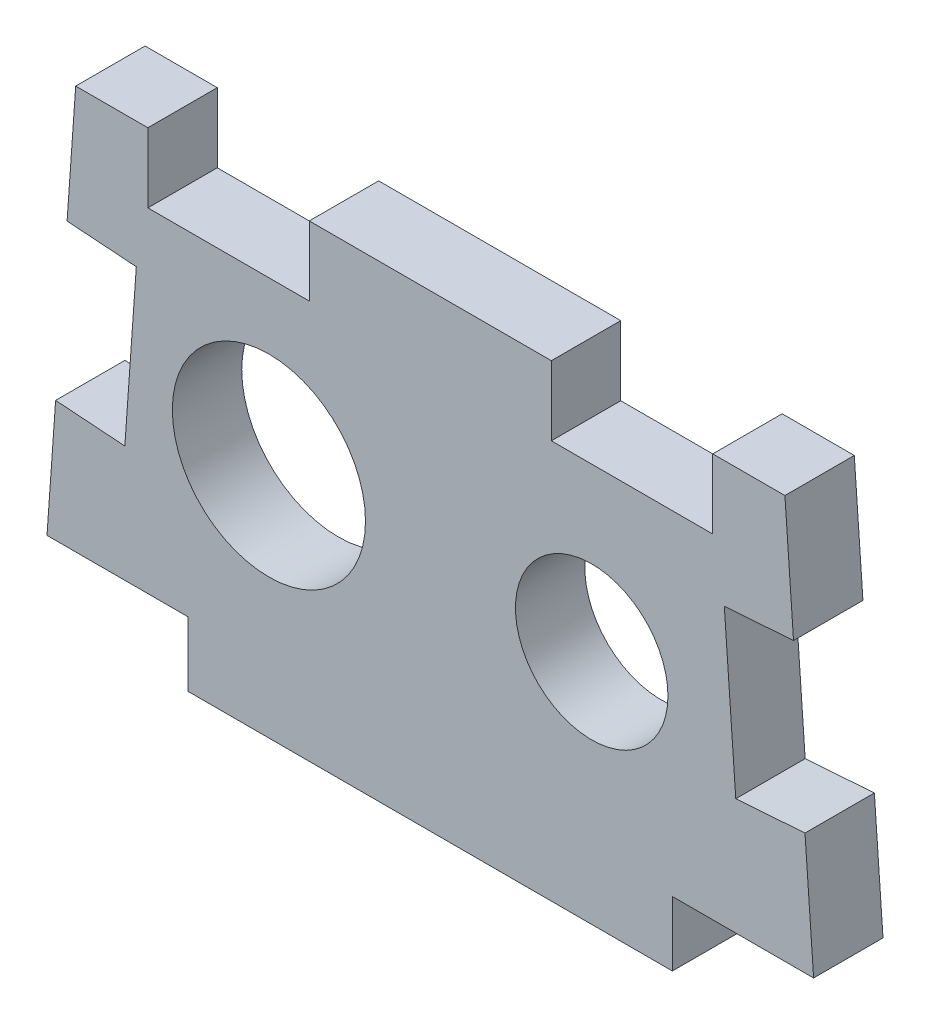
ISO-10303-21;
HEADER;
FILE_DESCRIPTION(('STEP AP214'),'2;1');
FILE_NAME('part.step','',(''),(''),'','','');
FILE_SCHEMA(('AUTOMOTIVE_DESIGN { 1 0 10303 214 1 1 1 1 }'));
ENDSEC;
DATA;
#1=APPLICATION_CONTEXT('core data for automotive mechanical design processes');
#2=APPLICATION_PROTOCOL_DEFINITION('international standard','automotive_design',2000,#1);
#3=PRODUCT_CONTEXT('',#1,'mechanical');
#4=PRODUCT('Part','Part','',(#3));
#5=PRODUCT_RELATED_PRODUCT_CATEGORY('part','',(#4));
#6=PRODUCT_DEFINITION_FORMATION('','',#4);
#7=PRODUCT_DEFINITION_CONTEXT('part definition',#1,'design');
#8=PRODUCT_DEFINITION('design','',#6,#7);
#9=PRODUCT_DEFINITION_SHAPE('','',#8);
#10=(LENGTH_UNIT() NAMED_UNIT(*) SI_UNIT(.MILLI.,.METRE.));
#11=(NAMED_UNIT(*) PLANE_ANGLE_UNIT() SI_UNIT($,.RADIAN.));
#12=(NAMED_UNIT(*) SI_UNIT($,.STERADIAN.) SOLID_ANGLE_UNIT());
#13=UNCERTAINTY_MEASURE_WITH_UNIT(LENGTH_MEASURE(1.E-05),#10,'distance_accuracy_value','');
#14=(GEOMETRIC_REPRESENTATION_CONTEXT(3) GLOBAL_UNCERTAINTY_ASSIGNED_CONTEXT((#13)) GLOBAL_UNIT_ASSIGNED_CONTEXT((#10,
#11,#12)) REPRESENTATION_CONTEXT('',''));
#15=CARTESIAN_POINT('',(0.,0.,0.));
#16=DIRECTION('',(0.,0.,1.));
#17=DIRECTION('',(1.,0.,0.));
#18=AXIS2_PLACEMENT_3D('',#15,#16,#17);
#19=CARTESIAN_POINT('',(-30.1625,-16.4925485415277,5.461));
#20=DIRECTION('',(0.,1.,0.));
#21=DIRECTION('',(0.,0.,1.));
#22=AXIS2_PLACEMENT_3D('',#19,#20,#21);
#23=PLANE('',#22);
#24=DIRECTION('',(0.,0.,1.));
#25=VECTOR('',#24,1.);
#26=CARTESIAN_POINT('',(19.05,-16.4925485415277,-38.4371747140707));
#27=LINE('',#26,#25);
#28=CARTESIAN_POINT('',(19.05,-16.4925485415277,0.));
#29=VERTEX_POINT('',#28);
#30=CARTESIAN_POINT('',(19.05,-16.4925485415277,5.461));
#31=VERTEX_POINT('',#30);
#32=EDGE_CURVE('E56',#29,#31,#27,.T.);
#33=ORIENTED_EDGE('',*,*,#32,.F.);
#34=DIRECTION('',(1.,0.,0.));
#35=VECTOR('',#34,1.);
#36=CARTESIAN_POINT('',(-30.1625,-16.4925485415277,0.));
#37=LINE('',#36,#35);
#38=CARTESIAN_POINT('',(30.1625,-16.4925485415277,0.));
#39=VERTEX_POINT('',#38);
#40=EDGE_CURVE('E376',#29,#39,#37,.T.);
#41=ORIENTED_EDGE('',*,*,#40,.T.);
#42=DIRECTION('',(0.,0.,-1.));
#43=VECTOR('',#42,1.);
#44=CARTESIAN_POINT('',(30.1625,-16.4925485415277,5.461));
#45=LINE('',#44,#43);
#46=CARTESIAN_POINT('',(30.1625,-16.4925485415277,5.461));
#47=VERTEX_POINT('',#46);
#48=EDGE_CURVE('E363',#47,#39,#45,.T.);
#49=ORIENTED_EDGE('',*,*,#48,.F.);
#50=DIRECTION('',(1.,0.,0.));
#51=VECTOR('',#50,1.);
#52=CARTESIAN_POINT('',(-30.1625,-16.4925485415277,5.461));
#53=LINE('',#52,#51);
#54=EDGE_CURVE('E361',#31,#47,#53,.T.);
#55=ORIENTED_EDGE('',*,*,#54,.F.);
#56=EDGE_LOOP('',(#33,#41,#49,#55));
#57=FACE_BOUND('',#56,.T.);
#58=ADVANCED_FACE('F33',(#57),#23,.F.);
#59=CARTESIAN_POINT('',(27.9036850161391,15.2574514584723,5.461));
#60=DIRECTION('',(-0.997478847817171,-0.0709644147254725,0.));
#61=DIRECTION('',(0.0709644147254726,-0.997478847817171,0.));
#62=AXIS2_PLACEMENT_3D('',#59,#60,#61);
#63=PLANE('',#62);
#64=DIRECTION('',(-0.0709644147254725,0.997478847817171,0.));
#65=VECTOR('',#64,1.);
#66=CARTESIAN_POINT('',(27.9036850161391,15.2574514584723,5.461));
#67=LINE('',#66,#65);
#68=CARTESIAN_POINT('',(28.5824684745628,5.71644214211136,5.461));
#69=VERTEX_POINT('',#68);
#70=CARTESIAN_POINT('',(27.9036850161391,15.2574514584723,5.461));
#71=VERTEX_POINT('',#70);
#72=EDGE_CURVE('E352',#69,#71,#67,.T.);
#73=ORIENTED_EDGE('',*,*,#72,.F.);
#74=DIRECTION('',(0.,0.,1.));
#75=VECTOR('',#74,1.);
#76=CARTESIAN_POINT('',(28.5824684745628,5.71644214211136,0.));
#77=LINE('',#76,#75);
#78=CARTESIAN_POINT('',(28.5824684745628,5.71644214211136,0.));
#79=VERTEX_POINT('',#78);
#80=EDGE_CURVE('E275',#79,#69,#77,.T.);
#81=ORIENTED_EDGE('',*,*,#80,.F.);
#82=DIRECTION('',(-0.0709644147254725,0.997478847817171,0.));
#83=VECTOR('',#82,1.);
#84=CARTESIAN_POINT('',(27.9036850161391,15.2574514584723,0.));
#85=LINE('',#84,#83);
#86=CARTESIAN_POINT('',(27.9036850161391,15.2574514584723,0.));
#87=VERTEX_POINT('',#86);
#88=EDGE_CURVE('E345',#79,#87,#85,.T.);
#89=ORIENTED_EDGE('',*,*,#88,.T.);
#90=DIRECTION('',(0.,0.,-1.));
#91=VECTOR('',#90,1.);
#92=CARTESIAN_POINT('',(27.9036850161391,15.2574514584723,5.461));
#93=LINE('',#92,#91);
#94=EDGE_CURVE('E11',#71,#87,#93,.T.);
#95=ORIENTED_EDGE('',*,*,#94,.F.);
#96=EDGE_LOOP('',(#73,#81,#89,#95));
#97=FACE_BOUND('',#96,.T.);
#98=ADVANCED_FACE('F433',(#97),#63,.F.);
#99=CARTESIAN_POINT('',(-27.903685016139,15.2574514584723,5.461));
#100=DIRECTION('',(0.,-1.,0.));
#101=DIRECTION('',(0.,0.,-1.));
#102=AXIS2_PLACEMENT_3D('',#99,#100,#101);
#103=PLANE('',#102);
#104=DIRECTION('',(-1.,0.,0.));
#105=VECTOR('',#104,1.);
#106=CARTESIAN_POINT('',(-27.903685016139,15.2574514584723,0.));
#107=LINE('',#106,#105);
#108=CARTESIAN_POINT('',(22.225,15.2574514584723,0.));
#109=VERTEX_POINT('',#108);
#110=EDGE_CURVE('E368',#87,#109,#107,.T.);
#111=ORIENTED_EDGE('',*,*,#110,.T.);
#112=DIRECTION('',(0.,0.,1.));
#113=VECTOR('',#112,1.);
#114=CARTESIAN_POINT('',(22.225,15.2574514584723,0.));
#115=LINE('',#114,#113);
#116=CARTESIAN_POINT('',(22.225,15.2574514584723,5.461));
#117=VERTEX_POINT('',#116);
#118=EDGE_CURVE('E242',#109,#117,#115,.T.);
#119=ORIENTED_EDGE('',*,*,#118,.T.);
#120=DIRECTION('',(-1.,0.,0.));
#121=VECTOR('',#120,1.);
#122=CARTESIAN_POINT('',(-27.903685016139,15.2574514584723,5.461));
#123=LINE('',#122,#121);
#124=EDGE_CURVE('E353',#71,#117,#123,.T.);
#125=ORIENTED_EDGE('',*,*,#124,.F.);
#126=ORIENTED_EDGE('',*,*,#94,.T.);
#127=EDGE_LOOP('',(#111,#119,#125,#126));
#128=FACE_BOUND('',#127,.T.);
#129=ADVANCED_FACE('F426',(#128),#103,.F.);
#130=CARTESIAN_POINT('',(-22.225,15.2574514584723,5.461));
#131=VERTEX_POINT('',#130);
#132=CARTESIAN_POINT('',(-27.903685016139,15.2574514584723,5.461));
#133=VERTEX_POINT('',#132);
#134=EDGE_CURVE('E351',#131,#133,#123,.T.);
#135=ORIENTED_EDGE('',*,*,#134,.F.);
#136=DIRECTION('',(0.,0.,1.));
#137=VECTOR('',#136,1.);
#138=CARTESIAN_POINT('',(-22.225,15.2574514584723,0.));
#139=LINE('',#138,#137);
#140=CARTESIAN_POINT('',(-22.225,15.2574514584723,0.));
#141=VERTEX_POINT('',#140);
#142=EDGE_CURVE('E327',#141,#131,#139,.T.);
#143=ORIENTED_EDGE('',*,*,#142,.F.);
#144=CARTESIAN_POINT('',(-27.903685016139,15.2574514584723,0.));
#145=VERTEX_POINT('',#144);
#146=EDGE_CURVE('E367',#141,#145,#107,.T.);
#147=ORIENTED_EDGE('',*,*,#146,.T.);
#148=DIRECTION('',(0.,0.,-1.));
#149=VECTOR('',#148,1.);
#150=CARTESIAN_POINT('',(-27.903685016139,15.2574514584723,5.461));
#151=LINE('',#150,#149);
#152=EDGE_CURVE('E41',#133,#145,#151,.T.);
#153=ORIENTED_EDGE('',*,*,#152,.F.);
#154=EDGE_LOOP('',(#135,#143,#147,#153));
#155=FACE_BOUND('',#154,.T.);
#156=ADVANCED_FACE('F423',(#155),#103,.F.);
#157=CARTESIAN_POINT('',(-27.903685016139,15.2574514584723,5.461));
#158=DIRECTION('',(0.997478847817171,-0.0709644147254746,0.));
#159=DIRECTION('',(0.0709644147254746,0.997478847817171,0.));
#160=AXIS2_PLACEMENT_3D('',#157,#158,#159);
#161=PLANE('',#160);
#162=DIRECTION('',(-0.0709644147254746,-0.997478847817171,0.));
#163=VECTOR('',#162,1.);
#164=CARTESIAN_POINT('',(-27.903685016139,15.2574514584723,5.461));
#165=LINE('',#164,#163);
#166=CARTESIAN_POINT('',(-29.4837165415763,-6.95153922516671,5.461));
#167=VERTEX_POINT('',#166);
#168=CARTESIAN_POINT('',(-30.1625,-16.4925485415277,5.461));
#169=VERTEX_POINT('',#168);
#170=EDGE_CURVE('E356',#167,#169,#165,.T.);
#171=ORIENTED_EDGE('',*,*,#170,.F.);
#172=DIRECTION('',(0.,0.,1.));
#173=VECTOR('',#172,1.);
#174=CARTESIAN_POINT('',(-29.4837165415763,-6.95153922516671,0.));
#175=LINE('',#174,#173);
#176=CARTESIAN_POINT('',(-29.4837165415763,-6.95153922516671,0.));
#177=VERTEX_POINT('',#176);
#178=EDGE_CURVE('E246',#177,#167,#175,.T.);
#179=ORIENTED_EDGE('',*,*,#178,.F.);
#180=DIRECTION('',(-0.0709644147254746,-0.997478847817171,0.));
#181=VECTOR('',#180,1.);
#182=CARTESIAN_POINT('',(-27.903685016139,15.2574514584723,0.));
#183=LINE('',#182,#181);
#184=CARTESIAN_POINT('',(-30.1625,-16.4925485415277,0.));
#185=VERTEX_POINT('',#184);
#186=EDGE_CURVE('E371',#177,#185,#183,.T.);
#187=ORIENTED_EDGE('',*,*,#186,.T.);
#188=DIRECTION('',(0.,0.,-1.));
#189=VECTOR('',#188,1.);
#190=CARTESIAN_POINT('',(-30.1625,-16.4925485415277,5.461));
#191=LINE('',#190,#189);
#192=EDGE_CURVE('E381',#169,#185,#191,.T.);
#193=ORIENTED_EDGE('',*,*,#192,.F.);
#194=EDGE_LOOP('',(#171,#179,#187,#193));
#195=FACE_BOUND('',#194,.T.);
#196=ADVANCED_FACE('F425',(#195),#161,.F.);
#197=CARTESIAN_POINT('',(0.,0.,5.461));
#198=DIRECTION('',(0.,0.,1.));
#199=DIRECTION('',(1.,0.,0.));
#200=AXIS2_PLACEMENT_3D('',#197,#198,#199);
#201=PLANE('',#200);
#202=DIRECTION('',(-0.997478847817171,-0.0709644147254728,0.));
#203=VECTOR('',#202,1.);
#204=CARTESIAN_POINT('',(28.5824684745628,5.71644214211136,5.461));
#205=LINE('',#204,#203);
#206=CARTESIAN_POINT('',(23.1352364866332,5.32890547329556,5.461));
#207=VERTEX_POINT('',#206);
#208=EDGE_CURVE('E231',#69,#207,#205,.T.);
#209=ORIENTED_EDGE('',*,*,#208,.F.);
#210=ORIENTED_EDGE('',*,*,#72,.T.);
#211=ORIENTED_EDGE('',*,*,#124,.T.);
#212=DIRECTION('',(0.,1.,0.));
#213=VECTOR('',#212,1.);
#214=CARTESIAN_POINT('',(22.225,15.2574514584723,5.461));
#215=LINE('',#214,#213);
#216=CARTESIAN_POINT('',(22.225,9.79645145847233,5.461));
#217=VERTEX_POINT('',#216);
#218=EDGE_CURVE('E243',#217,#117,#215,.T.);
#219=ORIENTED_EDGE('',*,*,#218,.F.);
#220=DIRECTION('',(1.,0.,0.));
#221=VECTOR('',#220,1.);
#222=CARTESIAN_POINT('',(22.225,9.79645145847233,5.461));
#223=LINE('',#222,#221);
#224=CARTESIAN_POINT('',(9.525,9.79645145847233,5.461));
#225=VERTEX_POINT('',#224);
#226=EDGE_CURVE('E236',#225,#217,#223,.T.);
#227=ORIENTED_EDGE('',*,*,#226,.F.);
#228=DIRECTION('',(0.,-1.,0.));
#229=VECTOR('',#228,1.);
#230=CARTESIAN_POINT('',(9.525,15.2574514584723,5.461));
#231=LINE('',#230,#229);
#232=CARTESIAN_POINT('',(9.525,15.2574514584723,5.461));
#233=VERTEX_POINT('',#232);
#234=EDGE_CURVE('E245',#233,#225,#231,.T.);
#235=ORIENTED_EDGE('',*,*,#234,.F.);
#236=CARTESIAN_POINT('',(-9.52500000000001,15.2574514584723,5.461));
#237=VERTEX_POINT('',#236);
#238=EDGE_CURVE('E357',#233,#237,#123,.T.);
#239=ORIENTED_EDGE('',*,*,#238,.T.);
#240=DIRECTION('',(0.,1.,0.));
#241=VECTOR('',#240,1.);
#242=CARTESIAN_POINT('',(-9.525,15.2574514584723,5.461));
#243=LINE('',#242,#241);
#244=CARTESIAN_POINT('',(-9.525,9.79645145847233,5.461));
#245=VERTEX_POINT('',#244);
#246=EDGE_CURVE('E314',#245,#237,#243,.T.);
#247=ORIENTED_EDGE('',*,*,#246,.F.);
#248=DIRECTION('',(1.,0.,0.));
#249=VECTOR('',#248,1.);
#250=CARTESIAN_POINT('',(-22.225,9.79645145847233,5.461));
#251=LINE('',#250,#249);
#252=CARTESIAN_POINT('',(-22.225,9.79645145847233,5.461));
#253=VERTEX_POINT('',#252);
#254=EDGE_CURVE('E323',#253,#245,#251,.T.);
#255=ORIENTED_EDGE('',*,*,#254,.F.);
#256=DIRECTION('',(0.,-1.,0.));
#257=VECTOR('',#256,1.);
#258=CARTESIAN_POINT('',(-22.225,15.2574514584723,5.461));
#259=LINE('',#258,#257);
#260=EDGE_CURVE('E253',#131,#253,#259,.T.);
#261=ORIENTED_EDGE('',*,*,#260,.F.);
#262=ORIENTED_EDGE('',*,*,#134,.T.);
#263=CARTESIAN_POINT('',(-28.5824684745628,5.71644214211136,5.461));
#264=VERTEX_POINT('',#263);
#265=EDGE_CURVE('E358',#133,#264,#165,.T.);
#266=ORIENTED_EDGE('',*,*,#265,.T.);
#267=DIRECTION('',(-0.997478847817171,0.0709644147254748,0.));
#268=VECTOR('',#267,1.);
#269=CARTESIAN_POINT('',(-28.5824684745628,5.71644214211136,5.461));
#270=LINE('',#269,#268);
#271=CARTESIAN_POINT('',(-23.1352364866332,5.32890547329554,5.461));
#272=VERTEX_POINT('',#271);
#273=EDGE_CURVE('E264',#272,#264,#270,.T.);
#274=ORIENTED_EDGE('',*,*,#273,.F.);
#275=DIRECTION('',(0.0709644147254746,0.997478847817171,0.));
#276=VECTOR('',#275,1.);
#277=CARTESIAN_POINT('',(-24.0364845536467,-7.33907589398252,5.461));
#278=LINE('',#277,#276);
#279=CARTESIAN_POINT('',(-24.0364845536467,-7.33907589398252,5.461));
#280=VERTEX_POINT('',#279);
#281=EDGE_CURVE('E274',#280,#272,#278,.T.);
#282=ORIENTED_EDGE('',*,*,#281,.F.);
#283=DIRECTION('',(0.997478847817171,-0.0709644147254751,0.));
#284=VECTOR('',#283,1.);
#285=CARTESIAN_POINT('',(-29.4837165415763,-6.95153922516671,5.461));
#286=LINE('',#285,#284);
#287=EDGE_CURVE('E271',#167,#280,#286,.T.);
#288=ORIENTED_EDGE('',*,*,#287,.F.);
#289=ORIENTED_EDGE('',*,*,#170,.T.);
#290=CARTESIAN_POINT('',(-19.05,-16.4925485415277,5.461));
#291=VERTEX_POINT('',#290);
#292=EDGE_CURVE('E219',#169,#291,#53,.T.);
#293=ORIENTED_EDGE('',*,*,#292,.T.);
#294=DIRECTION('',(0.,-1.,0.));
#295=VECTOR('',#294,1.);
#296=CARTESIAN_POINT('',(-19.05,-16.4925485415277,5.461));
#297=LINE('',#296,#295);
#298=CARTESIAN_POINT('',(-19.05,-21.5725485415277,5.461));
#299=VERTEX_POINT('',#298);
#300=EDGE_CURVE('E200',#291,#299,#297,.T.);
#301=ORIENTED_EDGE('',*,*,#300,.T.);
#302=DIRECTION('',(1.,0.,0.));
#303=VECTOR('',#302,1.);
#304=CARTESIAN_POINT('',(-19.05,-21.5725485415277,5.461));
#305=LINE('',#304,#303);
#306=CARTESIAN_POINT('',(19.05,-21.5725485415277,5.461));
#307=VERTEX_POINT('',#306);
#308=EDGE_CURVE('E209',#299,#307,#305,.T.);
#309=ORIENTED_EDGE('',*,*,#308,.T.);
#310=DIRECTION('',(0.,1.,0.));
#311=VECTOR('',#310,1.);
#312=CARTESIAN_POINT('',(19.05,-16.4925485415277,5.461));
#313=LINE('',#312,#311);
#314=EDGE_CURVE('E206',#307,#31,#313,.T.);
#315=ORIENTED_EDGE('',*,*,#314,.T.);
#316=ORIENTED_EDGE('',*,*,#54,.T.);
#317=CARTESIAN_POINT('',(29.4837165415763,-6.95153922516686,5.461));
#318=VERTEX_POINT('',#317);
#319=EDGE_CURVE('E348',#47,#318,#67,.T.);
#320=ORIENTED_EDGE('',*,*,#319,.T.);
#321=DIRECTION('',(0.997478847817171,0.0709644147254721,0.));
#322=VECTOR('',#321,1.);
#323=CARTESIAN_POINT('',(29.4837165415763,-6.95153922516671,5.461));
#324=LINE('',#323,#322);
#325=CARTESIAN_POINT('',(24.0364845536467,-7.33907589398251,5.461));
#326=VERTEX_POINT('',#325);
#327=EDGE_CURVE('E290',#326,#318,#324,.T.);
#328=ORIENTED_EDGE('',*,*,#327,.F.);
#329=DIRECTION('',(0.0709644147254724,-0.997478847817171,0.));
#330=VECTOR('',#329,1.);
#331=CARTESIAN_POINT('',(23.1352364866332,5.32890547329556,5.461));
#332=LINE('',#331,#330);
#333=EDGE_CURVE('E299',#207,#326,#332,.T.);
#334=ORIENTED_EDGE('',*,*,#333,.F.);
#335=EDGE_LOOP('',(#209,#210,#211,#219,#227,#235,#239,#247,#255,#261,#262,#266,#274,#282,#288,
#289,#293,#301,#309,#315,#316,#320,#328,#334));
#336=FACE_BOUND('',#335,.T.);
#337=CARTESIAN_POINT('',(-12.7,-3.00023153008812,5.461));
#338=DIRECTION('',(0.,0.,1.));
#339=DIRECTION('',(1.,0.,0.));
#340=AXIS2_PLACEMENT_3D('',#337,#338,#339);
#341=CIRCLE('',#340,7.6);
#342=CARTESIAN_POINT('',(-5.1,-3.00023153008812,5.461));
#343=VERTEX_POINT('',#342);
#344=EDGE_CURVE('E342',#343,#343,#341,.T.);
#345=ORIENTED_EDGE('',*,*,#344,.F.);
#346=EDGE_LOOP('',(#345));
#347=FACE_BOUND('',#346,.T.);
#348=CARTESIAN_POINT('',(12.7,-3.00023153008812,5.461));
#349=DIRECTION('',(0.,0.,1.));
#350=DIRECTION('',(1.,0.,0.));
#351=AXIS2_PLACEMENT_3D('',#348,#349,#350);
#352=CIRCLE('',#351,5.99999999999999);
#353=CARTESIAN_POINT('',(18.7,-3.00023153008812,5.461));
#354=VERTEX_POINT('',#353);
#355=EDGE_CURVE('E336',#354,#354,#352,.T.);
#356=ORIENTED_EDGE('',*,*,#355,.F.);
#357=EDGE_LOOP('',(#356));
#358=FACE_BOUND('',#357,.T.);
#359=ADVANCED_FACE('F217',(#336,#347,#358),#201,.T.);
#360=CARTESIAN_POINT('',(0.,0.,0.));
#361=DIRECTION('',(0.,0.,1.));
#362=DIRECTION('',(1.,0.,0.));
#363=AXIS2_PLACEMENT_3D('',#360,#361,#362);
#364=PLANE('',#363);
#365=ORIENTED_EDGE('',*,*,#88,.F.);
#366=DIRECTION('',(-0.997478847817171,-0.0709644147254728,0.));
#367=VECTOR('',#366,1.);
#368=CARTESIAN_POINT('',(28.5824684745628,5.71644214211136,0.));
#369=LINE('',#368,#367);
#370=CARTESIAN_POINT('',(23.1352364866332,5.32890547329556,0.));
#371=VERTEX_POINT('',#370);
#372=EDGE_CURVE('E286',#79,#371,#369,.T.);
#373=ORIENTED_EDGE('',*,*,#372,.T.);
#374=DIRECTION('',(0.0709644147254724,-0.997478847817171,0.));
#375=VECTOR('',#374,1.);
#376=CARTESIAN_POINT('',(23.1352364866332,5.32890547329556,0.));
#377=LINE('',#376,#375);
#378=CARTESIAN_POINT('',(24.0364845536467,-7.33907589398251,0.));
#379=VERTEX_POINT('',#378);
#380=EDGE_CURVE('E289',#371,#379,#377,.T.);
#381=ORIENTED_EDGE('',*,*,#380,.T.);
#382=DIRECTION('',(0.997478847817171,0.0709644147254721,0.));
#383=VECTOR('',#382,1.);
#384=CARTESIAN_POINT('',(29.4837165415763,-6.95153922516671,0.));
#385=LINE('',#384,#383);
#386=CARTESIAN_POINT('',(29.4837165415763,-6.95153922516671,0.));
#387=VERTEX_POINT('',#386);
#388=EDGE_CURVE('E293',#379,#387,#385,.T.);
#389=ORIENTED_EDGE('',*,*,#388,.T.);
#390=EDGE_CURVE('E364',#39,#387,#85,.T.);
#391=ORIENTED_EDGE('',*,*,#390,.F.);
#392=ORIENTED_EDGE('',*,*,#40,.F.);
#393=DIRECTION('',(0.,-1.,0.));
#394=VECTOR('',#393,1.);
#395=CARTESIAN_POINT('',(19.05,-16.4925485415277,0.));
#396=LINE('',#395,#394);
#397=CARTESIAN_POINT('',(19.05,-21.5725485415277,0.));
#398=VERTEX_POINT('',#397);
#399=EDGE_CURVE('E226',#29,#398,#396,.T.);
#400=ORIENTED_EDGE('',*,*,#399,.T.);
#401=DIRECTION('',(-1.,0.,0.));
#402=VECTOR('',#401,1.);
#403=CARTESIAN_POINT('',(-19.05,-21.5725485415277,0.));
#404=LINE('',#403,#402);
#405=CARTESIAN_POINT('',(-19.05,-21.5725485415277,0.));
#406=VERTEX_POINT('',#405);
#407=EDGE_CURVE('E229',#398,#406,#404,.T.);
#408=ORIENTED_EDGE('',*,*,#407,.T.);
#409=DIRECTION('',(0.,1.,0.));
#410=VECTOR('',#409,1.);
#411=CARTESIAN_POINT('',(-19.05,-16.4925485415277,0.));
#412=LINE('',#411,#410);
#413=CARTESIAN_POINT('',(-19.05,-16.4925485415277,0.));
#414=VERTEX_POINT('',#413);
#415=EDGE_CURVE('E202',#406,#414,#412,.T.);
#416=ORIENTED_EDGE('',*,*,#415,.T.);
#417=EDGE_CURVE('E377',#185,#414,#37,.T.);
#418=ORIENTED_EDGE('',*,*,#417,.F.);
#419=ORIENTED_EDGE('',*,*,#186,.F.);
#420=DIRECTION('',(0.997478847817171,-0.0709644147254751,0.));
#421=VECTOR('',#420,1.);
#422=CARTESIAN_POINT('',(-29.4837165415763,-6.95153922516671,0.));
#423=LINE('',#422,#421);
#424=CARTESIAN_POINT('',(-24.0364845536467,-7.33907589398252,0.));
#425=VERTEX_POINT('',#424);
#426=EDGE_CURVE('E260',#177,#425,#423,.T.);
#427=ORIENTED_EDGE('',*,*,#426,.T.);
#428=DIRECTION('',(0.0709644147254746,0.997478847817171,0.));
#429=VECTOR('',#428,1.);
#430=CARTESIAN_POINT('',(-24.0364845536467,-7.33907589398252,0.));
#431=LINE('',#430,#429);
#432=CARTESIAN_POINT('',(-23.1352364866332,5.32890547329554,0.));
#433=VERTEX_POINT('',#432);
#434=EDGE_CURVE('E263',#425,#433,#431,.T.);
#435=ORIENTED_EDGE('',*,*,#434,.T.);
#436=DIRECTION('',(-0.997478847817171,0.0709644147254748,0.));
#437=VECTOR('',#436,1.);
#438=CARTESIAN_POINT('',(-28.5824684745628,5.71644214211136,0.));
#439=LINE('',#438,#437);
#440=CARTESIAN_POINT('',(-28.5824684745628,5.71644214211136,0.));
#441=VERTEX_POINT('',#440);
#442=EDGE_CURVE('E267',#433,#441,#439,.T.);
#443=ORIENTED_EDGE('',*,*,#442,.T.);
#444=EDGE_CURVE('E373',#145,#441,#183,.T.);
#445=ORIENTED_EDGE('',*,*,#444,.F.);
#446=ORIENTED_EDGE('',*,*,#146,.F.);
#447=DIRECTION('',(0.,-1.,0.));
#448=VECTOR('',#447,1.);
#449=CARTESIAN_POINT('',(-22.225,15.2574514584723,0.));
#450=LINE('',#449,#448);
#451=CARTESIAN_POINT('',(-22.225,9.79645145847233,0.));
#452=VERTEX_POINT('',#451);
#453=EDGE_CURVE('E310',#141,#452,#450,.T.);
#454=ORIENTED_EDGE('',*,*,#453,.T.);
#455=DIRECTION('',(1.,0.,0.));
#456=VECTOR('',#455,1.);
#457=CARTESIAN_POINT('',(-22.225,9.79645145847233,0.));
#458=LINE('',#457,#456);
#459=CARTESIAN_POINT('',(-9.525,9.79645145847233,0.));
#460=VERTEX_POINT('',#459);
#461=EDGE_CURVE('E313',#452,#460,#458,.T.);
#462=ORIENTED_EDGE('',*,*,#461,.T.);
#463=DIRECTION('',(0.,1.,0.));
#464=VECTOR('',#463,1.);
#465=CARTESIAN_POINT('',(-9.525,15.2574514584723,0.));
#466=LINE('',#465,#464);
#467=CARTESIAN_POINT('',(-9.525,15.2574514584723,0.));
#468=VERTEX_POINT('',#467);
#469=EDGE_CURVE('E317',#460,#468,#466,.T.);
#470=ORIENTED_EDGE('',*,*,#469,.T.);
#471=CARTESIAN_POINT('',(9.525,15.2574514584723,0.));
#472=VERTEX_POINT('',#471);
#473=EDGE_CURVE('E372',#472,#468,#107,.T.);
#474=ORIENTED_EDGE('',*,*,#473,.F.);
#475=DIRECTION('',(0.,-1.,0.));
#476=VECTOR('',#475,1.);
#477=CARTESIAN_POINT('',(9.525,15.2574514584723,0.));
#478=LINE('',#477,#476);
#479=CARTESIAN_POINT('',(9.525,9.79645145847233,0.));
#480=VERTEX_POINT('',#479);
#481=EDGE_CURVE('E235',#472,#480,#478,.T.);
#482=ORIENTED_EDGE('',*,*,#481,.T.);
#483=DIRECTION('',(1.,0.,0.));
#484=VECTOR('',#483,1.);
#485=CARTESIAN_POINT('',(22.225,9.79645145847233,0.));
#486=LINE('',#485,#484);
#487=CARTESIAN_POINT('',(22.225,9.79645145847233,0.));
#488=VERTEX_POINT('',#487);
#489=EDGE_CURVE('E239',#480,#488,#486,.T.);
#490=ORIENTED_EDGE('',*,*,#489,.T.);
#491=DIRECTION('',(0.,1.,0.));
#492=VECTOR('',#491,1.);
#493=CARTESIAN_POINT('',(22.225,15.2574514584723,0.));
#494=LINE('',#493,#492);
#495=EDGE_CURVE('E232',#488,#109,#494,.T.);
#496=ORIENTED_EDGE('',*,*,#495,.T.);
#497=ORIENTED_EDGE('',*,*,#110,.F.);
#498=EDGE_LOOP('',(#365,#373,#381,#389,#391,#392,#400,#408,#416,#418,#419,#427,#435,#443,#445,
#446,#454,#462,#470,#474,#482,#490,#496,#497));
#499=FACE_BOUND('',#498,.T.);
#500=CARTESIAN_POINT('',(-12.7,-3.00023153008812,0.));
#501=DIRECTION('',(0.,0.,1.));
#502=DIRECTION('',(1.,0.,0.));
#503=AXIS2_PLACEMENT_3D('',#500,#501,#502);
#504=CIRCLE('',#503,7.6);
#505=CARTESIAN_POINT('',(-5.1,-3.00023153008812,0.));
#506=VERTEX_POINT('',#505);
#507=EDGE_CURVE('E339',#506,#506,#504,.T.);
#508=ORIENTED_EDGE('',*,*,#507,.T.);
#509=EDGE_LOOP('',(#508));
#510=FACE_BOUND('',#509,.T.);
#511=CARTESIAN_POINT('',(12.7,-3.00023153008812,0.));
#512=DIRECTION('',(0.,0.,1.));
#513=DIRECTION('',(1.,0.,0.));
#514=AXIS2_PLACEMENT_3D('',#511,#512,#513);
#515=CIRCLE('',#514,5.99999999999999);
#516=CARTESIAN_POINT('',(18.7,-3.00023153008812,0.));
#517=VERTEX_POINT('',#516);
#518=EDGE_CURVE('E329',#517,#517,#515,.T.);
#519=ORIENTED_EDGE('',*,*,#518,.T.);
#520=EDGE_LOOP('',(#519));
#521=FACE_BOUND('',#520,.T.);
#522=ADVANCED_FACE('F394',(#499,#510,#521),#364,.F.);
#523=ORIENTED_EDGE('',*,*,#390,.T.);
#524=DIRECTION('',(0.,0.,1.));
#525=VECTOR('',#524,1.);
#526=CARTESIAN_POINT('',(29.4837165415763,-6.95153922516671,0.));
#527=LINE('',#526,#525);
#528=EDGE_CURVE('E304',#387,#318,#527,.T.);
#529=ORIENTED_EDGE('',*,*,#528,.T.);
#530=ORIENTED_EDGE('',*,*,#319,.F.);
#531=ORIENTED_EDGE('',*,*,#48,.T.);
#532=EDGE_LOOP('',(#523,#529,#530,#531));
#533=FACE_BOUND('',#532,.T.);
#534=ADVANCED_FACE('F35',(#533),#63,.F.);
#535=ORIENTED_EDGE('',*,*,#238,.F.);
#536=DIRECTION('',(0.,0.,1.));
#537=VECTOR('',#536,1.);
#538=CARTESIAN_POINT('',(9.525,15.2574514584723,0.));
#539=LINE('',#538,#537);
#540=EDGE_CURVE('E256',#472,#233,#539,.T.);
#541=ORIENTED_EDGE('',*,*,#540,.F.);
#542=ORIENTED_EDGE('',*,*,#473,.T.);
#543=DIRECTION('',(0.,0.,1.));
#544=VECTOR('',#543,1.);
#545=CARTESIAN_POINT('',(-9.525,15.2574514584723,0.));
#546=LINE('',#545,#544);
#547=EDGE_CURVE('E330',#468,#237,#546,.T.);
#548=ORIENTED_EDGE('',*,*,#547,.T.);
#549=EDGE_LOOP('',(#535,#541,#542,#548));
#550=FACE_BOUND('',#549,.T.);
#551=ADVANCED_FACE('F412',(#550),#103,.F.);
#552=ORIENTED_EDGE('',*,*,#444,.T.);
#553=DIRECTION('',(0.,0.,1.));
#554=VECTOR('',#553,1.);
#555=CARTESIAN_POINT('',(-28.5824684745628,5.71644214211136,0.));
#556=LINE('',#555,#554);
#557=EDGE_CURVE('E280',#441,#264,#556,.T.);
#558=ORIENTED_EDGE('',*,*,#557,.T.);
#559=ORIENTED_EDGE('',*,*,#265,.F.);
#560=ORIENTED_EDGE('',*,*,#152,.T.);
#561=EDGE_LOOP('',(#552,#558,#559,#560));
#562=FACE_BOUND('',#561,.T.);
#563=ADVANCED_FACE('F388',(#562),#161,.F.);
#564=ORIENTED_EDGE('',*,*,#417,.T.);
#565=DIRECTION('',(0.,0.,1.));
#566=VECTOR('',#565,1.);
#567=CARTESIAN_POINT('',(-19.05,-16.4925485415277,-38.4371747140707));
#568=LINE('',#567,#566);
#569=EDGE_CURVE('E48',#414,#291,#568,.T.);
#570=ORIENTED_EDGE('',*,*,#569,.T.);
#571=ORIENTED_EDGE('',*,*,#292,.F.);
#572=ORIENTED_EDGE('',*,*,#192,.T.);
#573=EDGE_LOOP('',(#564,#570,#571,#572));
#574=FACE_BOUND('',#573,.T.);
#575=ADVANCED_FACE('F438',(#574),#23,.F.);
#576=CARTESIAN_POINT('',(-12.7,-3.00023153008812,5.461));
#577=DIRECTION('',(0.,0.,-1.));
#578=DIRECTION('',(-1.,0.,0.));
#579=AXIS2_PLACEMENT_3D('',#576,#577,#578);
#580=CYLINDRICAL_SURFACE('',#579,7.6);
#581=ORIENTED_EDGE('',*,*,#344,.T.);
#582=EDGE_LOOP('',(#581));
#583=FACE_BOUND('',#582,.T.);
#584=ORIENTED_EDGE('',*,*,#507,.F.);
#585=EDGE_LOOP('',(#584));
#586=FACE_BOUND('',#585,.T.);
#587=ADVANCED_FACE('F445',(#583,#586),#580,.F.);
#588=CARTESIAN_POINT('',(12.7,-3.00023153008812,5.461));
#589=DIRECTION('',(0.,0.,-1.));
#590=DIRECTION('',(-1.,0.,0.));
#591=AXIS2_PLACEMENT_3D('',#588,#589,#590);
#592=CYLINDRICAL_SURFACE('',#591,5.99999999999999);
#593=ORIENTED_EDGE('',*,*,#355,.T.);
#594=EDGE_LOOP('',(#593));
#595=FACE_BOUND('',#594,.T.);
#596=ORIENTED_EDGE('',*,*,#518,.F.);
#597=EDGE_LOOP('',(#596));
#598=FACE_BOUND('',#597,.T.);
#599=ADVANCED_FACE('F450',(#595,#598),#592,.F.);
#600=CARTESIAN_POINT('',(-29.4837165415763,-6.95153922516671,0.));
#601=DIRECTION('',(-0.0709644147254751,-0.997478847817171,0.));
#602=DIRECTION('',(0.997478847817171,-0.0709644147254751,0.));
#603=AXIS2_PLACEMENT_3D('',#600,#601,#602);
#604=PLANE('',#603);
#605=ORIENTED_EDGE('',*,*,#287,.T.);
#606=DIRECTION('',(0.,0.,1.));
#607=VECTOR('',#606,1.);
#608=CARTESIAN_POINT('',(-24.0364845536467,-7.33907589398252,0.));
#609=LINE('',#608,#607);
#610=EDGE_CURVE('E270',#425,#280,#609,.T.);
#611=ORIENTED_EDGE('',*,*,#610,.F.);
#612=ORIENTED_EDGE('',*,*,#426,.F.);
#613=ORIENTED_EDGE('',*,*,#178,.T.);
#614=EDGE_LOOP('',(#605,#611,#612,#613));
#615=FACE_BOUND('',#614,.T.);
#616=ADVANCED_FACE('F502',(#615),#604,.F.);
#617=CARTESIAN_POINT('',(-28.5824684745628,5.71644214211136,0.));
#618=DIRECTION('',(0.0709644147254748,0.997478847817171,0.));
#619=DIRECTION('',(-0.997478847817171,0.0709644147254748,0.));
#620=AXIS2_PLACEMENT_3D('',#617,#618,#619);
#621=PLANE('',#620);
#622=ORIENTED_EDGE('',*,*,#273,.T.);
#623=ORIENTED_EDGE('',*,*,#557,.F.);
#624=ORIENTED_EDGE('',*,*,#442,.F.);
#625=DIRECTION('',(0.,0.,1.));
#626=VECTOR('',#625,1.);
#627=CARTESIAN_POINT('',(-23.1352364866332,5.32890547329554,0.));
#628=LINE('',#627,#626);
#629=EDGE_CURVE('E283',#433,#272,#628,.T.);
#630=ORIENTED_EDGE('',*,*,#629,.T.);
#631=EDGE_LOOP('',(#622,#623,#624,#630));
#632=FACE_BOUND('',#631,.T.);
#633=ADVANCED_FACE('F399',(#632),#621,.F.);
#634=CARTESIAN_POINT('',(-24.0364845536467,-7.33907589398252,0.));
#635=DIRECTION('',(0.997478847817171,-0.0709644147254746,0.));
#636=DIRECTION('',(0.0709644147254746,0.997478847817171,0.));
#637=AXIS2_PLACEMENT_3D('',#634,#635,#636);
#638=PLANE('',#637);
#639=ORIENTED_EDGE('',*,*,#281,.T.);
#640=ORIENTED_EDGE('',*,*,#629,.F.);
#641=ORIENTED_EDGE('',*,*,#434,.F.);
#642=ORIENTED_EDGE('',*,*,#610,.T.);
#643=EDGE_LOOP('',(#639,#640,#641,#642));
#644=FACE_BOUND('',#643,.T.);
#645=ADVANCED_FACE('F501',(#644),#638,.F.);
#646=CARTESIAN_POINT('',(-22.225,15.2574514584723,0.));
#647=DIRECTION('',(-1.,0.,0.));
#648=DIRECTION('',(0.,0.,1.));
#649=AXIS2_PLACEMENT_3D('',#646,#647,#648);
#650=PLANE('',#649);
#651=ORIENTED_EDGE('',*,*,#260,.T.);
#652=DIRECTION('',(0.,0.,1.));
#653=VECTOR('',#652,1.);
#654=CARTESIAN_POINT('',(-22.225,9.79645145847233,0.));
#655=LINE('',#654,#653);
#656=EDGE_CURVE('E320',#452,#253,#655,.T.);
#657=ORIENTED_EDGE('',*,*,#656,.F.);
#658=ORIENTED_EDGE('',*,*,#453,.F.);
#659=ORIENTED_EDGE('',*,*,#142,.T.);
#660=EDGE_LOOP('',(#651,#657,#658,#659));
#661=FACE_BOUND('',#660,.T.);
#662=ADVANCED_FACE('F422',(#661),#650,.F.);
#663=CARTESIAN_POINT('',(-9.525,15.2574514584723,0.));
#664=DIRECTION('',(1.,0.,0.));
#665=DIRECTION('',(0.,0.,-1.));
#666=AXIS2_PLACEMENT_3D('',#663,#664,#665);
#667=PLANE('',#666);
#668=ORIENTED_EDGE('',*,*,#246,.T.);
#669=ORIENTED_EDGE('',*,*,#547,.F.);
#670=ORIENTED_EDGE('',*,*,#469,.F.);
#671=DIRECTION('',(0.,0.,1.));
#672=VECTOR('',#671,1.);
#673=CARTESIAN_POINT('',(-9.525,9.79645145847233,0.));
#674=LINE('',#673,#672);
#675=EDGE_CURVE('E333',#460,#245,#674,.T.);
#676=ORIENTED_EDGE('',*,*,#675,.T.);
#677=EDGE_LOOP('',(#668,#669,#670,#676));
#678=FACE_BOUND('',#677,.T.);
#679=ADVANCED_FACE('F417',(#678),#667,.F.);
#680=CARTESIAN_POINT('',(-22.225,9.79645145847233,0.));
#681=DIRECTION('',(0.,-1.,0.));
#682=DIRECTION('',(0.,0.,-1.));
#683=AXIS2_PLACEMENT_3D('',#680,#681,#682);
#684=PLANE('',#683);
#685=ORIENTED_EDGE('',*,*,#254,.T.);
#686=ORIENTED_EDGE('',*,*,#675,.F.);
#687=ORIENTED_EDGE('',*,*,#461,.F.);
#688=ORIENTED_EDGE('',*,*,#656,.T.);
#689=EDGE_LOOP('',(#685,#686,#687,#688));
#690=FACE_BOUND('',#689,.T.);
#691=ADVANCED_FACE('F420',(#690),#684,.F.);
#692=CARTESIAN_POINT('',(22.225,15.2574514584723,0.));
#693=DIRECTION('',(1.,0.,0.));
#694=DIRECTION('',(0.,0.,-1.));
#695=AXIS2_PLACEMENT_3D('',#692,#693,#694);
#696=PLANE('',#695);
#697=ORIENTED_EDGE('',*,*,#218,.T.);
#698=ORIENTED_EDGE('',*,*,#118,.F.);
#699=ORIENTED_EDGE('',*,*,#495,.F.);
#700=DIRECTION('',(0.,0.,1.));
#701=VECTOR('',#700,1.);
#702=CARTESIAN_POINT('',(22.225,9.79645145847233,0.));
#703=LINE('',#702,#701);
#704=EDGE_CURVE('E251',#488,#217,#703,.T.);
#705=ORIENTED_EDGE('',*,*,#704,.T.);
#706=EDGE_LOOP('',(#697,#698,#699,#705));
#707=FACE_BOUND('',#706,.T.);
#708=ADVANCED_FACE('F479',(#707),#696,.F.);
#709=CARTESIAN_POINT('',(22.225,9.79645145847233,0.));
#710=DIRECTION('',(0.,-1.,0.));
#711=DIRECTION('',(0.,0.,-1.));
#712=AXIS2_PLACEMENT_3D('',#709,#710,#711);
#713=PLANE('',#712);
#714=ORIENTED_EDGE('',*,*,#226,.T.);
#715=ORIENTED_EDGE('',*,*,#704,.F.);
#716=ORIENTED_EDGE('',*,*,#489,.F.);
#717=DIRECTION('',(0.,0.,1.));
#718=VECTOR('',#717,1.);
#719=CARTESIAN_POINT('',(9.525,9.79645145847233,0.));
#720=LINE('',#719,#718);
#721=EDGE_CURVE('E254',#480,#225,#720,.T.);
#722=ORIENTED_EDGE('',*,*,#721,.T.);
#723=EDGE_LOOP('',(#714,#715,#716,#722));
#724=FACE_BOUND('',#723,.T.);
#725=ADVANCED_FACE('F483',(#724),#713,.F.);
#726=CARTESIAN_POINT('',(9.525,15.2574514584723,0.));
#727=DIRECTION('',(-1.,0.,0.));
#728=DIRECTION('',(0.,-1.,0.));
#729=AXIS2_PLACEMENT_3D('',#726,#727,#728);
#730=PLANE('',#729);
#731=ORIENTED_EDGE('',*,*,#234,.T.);
#732=ORIENTED_EDGE('',*,*,#721,.F.);
#733=ORIENTED_EDGE('',*,*,#481,.F.);
#734=ORIENTED_EDGE('',*,*,#540,.T.);
#735=EDGE_LOOP('',(#731,#732,#733,#734));
#736=FACE_BOUND('',#735,.T.);
#737=ADVANCED_FACE('F485',(#736),#730,.F.);
#738=CARTESIAN_POINT('',(28.5824684745628,5.71644214211136,0.));
#739=DIRECTION('',(-0.0709644147254728,0.997478847817171,0.));
#740=DIRECTION('',(-0.997478847817171,-0.0709644147254728,0.));
#741=AXIS2_PLACEMENT_3D('',#738,#739,#740);
#742=PLANE('',#741);
#743=ORIENTED_EDGE('',*,*,#208,.T.);
#744=DIRECTION('',(0.,0.,1.));
#745=VECTOR('',#744,1.);
#746=CARTESIAN_POINT('',(23.1352364866332,5.32890547329556,0.));
#747=LINE('',#746,#745);
#748=EDGE_CURVE('E296',#371,#207,#747,.T.);
#749=ORIENTED_EDGE('',*,*,#748,.F.);
#750=ORIENTED_EDGE('',*,*,#372,.F.);
#751=ORIENTED_EDGE('',*,*,#80,.T.);
#752=EDGE_LOOP('',(#743,#749,#750,#751));
#753=FACE_BOUND('',#752,.T.);
#754=ADVANCED_FACE('F487',(#753),#742,.F.);
#755=CARTESIAN_POINT('',(29.4837165415763,-6.95153922516671,0.));
#756=DIRECTION('',(0.0709644147254721,-0.997478847817171,0.));
#757=DIRECTION('',(0.997478847817171,0.0709644147254721,0.));
#758=AXIS2_PLACEMENT_3D('',#755,#756,#757);
#759=PLANE('',#758);
#760=ORIENTED_EDGE('',*,*,#327,.T.);
#761=ORIENTED_EDGE('',*,*,#528,.F.);
#762=ORIENTED_EDGE('',*,*,#388,.F.);
#763=DIRECTION('',(0.,0.,1.));
#764=VECTOR('',#763,1.);
#765=CARTESIAN_POINT('',(24.0364845536467,-7.33907589398251,0.));
#766=LINE('',#765,#764);
#767=EDGE_CURVE('E307',#379,#326,#766,.T.);
#768=ORIENTED_EDGE('',*,*,#767,.T.);
#769=EDGE_LOOP('',(#760,#761,#762,#768));
#770=FACE_BOUND('',#769,.T.);
#771=ADVANCED_FACE('F466',(#770),#759,.F.);
#772=CARTESIAN_POINT('',(23.1352364866332,5.32890547329556,0.));
#773=DIRECTION('',(-0.997478847817171,-0.0709644147254724,0.));
#774=DIRECTION('',(0.0709644147254724,-0.997478847817171,0.));
#775=AXIS2_PLACEMENT_3D('',#772,#773,#774);
#776=PLANE('',#775);
#777=ORIENTED_EDGE('',*,*,#333,.T.);
#778=ORIENTED_EDGE('',*,*,#767,.F.);
#779=ORIENTED_EDGE('',*,*,#380,.F.);
#780=ORIENTED_EDGE('',*,*,#748,.T.);
#781=EDGE_LOOP('',(#777,#778,#779,#780));
#782=FACE_BOUND('',#781,.T.);
#783=ADVANCED_FACE('F469',(#782),#776,.F.);
#784=CARTESIAN_POINT('',(-19.05,-16.4925485415277,-38.4371747140707));
#785=DIRECTION('',(-1.,0.,0.));
#786=DIRECTION('',(0.,0.,1.));
#787=AXIS2_PLACEMENT_3D('',#784,#785,#786);
#788=PLANE('',#787);
#789=ORIENTED_EDGE('',*,*,#415,.F.);
#790=DIRECTION('',(0.,0.,1.));
#791=VECTOR('',#790,1.);
#792=CARTESIAN_POINT('',(-19.05,-21.5725485415277,-38.4371747140707));
#793=LINE('',#792,#791);
#794=EDGE_CURVE('E196',#406,#299,#793,.T.);
#795=ORIENTED_EDGE('',*,*,#794,.T.);
#796=ORIENTED_EDGE('',*,*,#300,.F.);
#797=ORIENTED_EDGE('',*,*,#569,.F.);
#798=EDGE_LOOP('',(#789,#795,#796,#797));
#799=FACE_BOUND('',#798,.T.);
#800=ADVANCED_FACE('F198',(#799),#788,.T.);
#801=CARTESIAN_POINT('',(19.05,-16.4925485415277,-38.4371747140707));
#802=DIRECTION('',(1.,0.,0.));
#803=DIRECTION('',(0.,0.,-1.));
#804=AXIS2_PLACEMENT_3D('',#801,#802,#803);
#805=PLANE('',#804);
#806=ORIENTED_EDGE('',*,*,#399,.F.);
#807=ORIENTED_EDGE('',*,*,#32,.T.);
#808=ORIENTED_EDGE('',*,*,#314,.F.);
#809=DIRECTION('',(0.,0.,1.));
#810=VECTOR('',#809,1.);
#811=CARTESIAN_POINT('',(19.05,-21.5725485415277,-38.4371747140707));
#812=LINE('',#811,#810);
#813=EDGE_CURVE('E205',#398,#307,#812,.T.);
#814=ORIENTED_EDGE('',*,*,#813,.F.);
#815=EDGE_LOOP('',(#806,#807,#808,#814));
#816=FACE_BOUND('',#815,.T.);
#817=ADVANCED_FACE('F459',(#816),#805,.T.);
#818=CARTESIAN_POINT('',(-19.05,-21.5725485415277,-38.4371747140707));
#819=DIRECTION('',(0.,-1.,0.));
#820=DIRECTION('',(1.,0.,0.));
#821=AXIS2_PLACEMENT_3D('',#818,#819,#820);
#822=PLANE('',#821);
#823=ORIENTED_EDGE('',*,*,#407,.F.);
#824=ORIENTED_EDGE('',*,*,#813,.T.);
#825=ORIENTED_EDGE('',*,*,#308,.F.);
#826=ORIENTED_EDGE('',*,*,#794,.F.);
#827=EDGE_LOOP('',(#823,#824,#825,#826));
#828=FACE_BOUND('',#827,.T.);
#829=ADVANCED_FACE('F210',(#828),#822,.T.);
#830=CLOSED_SHELL('',(#58,#98,#129,#156,#196,#359,#522,#534,#551,#563,#575,#587,#599,#616,#633,
#645,#662,#679,#691,#708,#725,#737,#754,#771,#783,#800,#817,#829));
#831=MANIFOLD_SOLID_BREP('B2',#830);
#832=ADVANCED_BREP_SHAPE_REPRESENTATION('',(#18,#831),#14);
#833=SHAPE_DEFINITION_REPRESENTATION(#9,#832);
ENDSEC;
END-ISO-10303-21;
